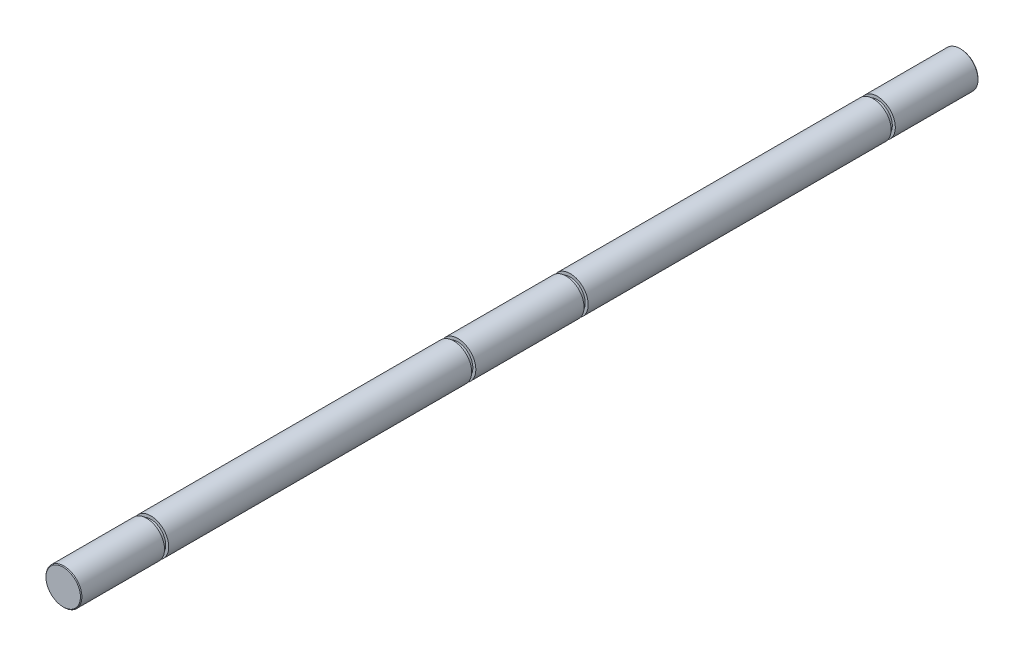
ISO-10303-21;
HEADER;
FILE_DESCRIPTION(('STEP AP214'),'2;1');
FILE_NAME('part.step','',(''),(''),'','','');
FILE_SCHEMA(('AUTOMOTIVE_DESIGN { 1 0 10303 214 1 1 1 1 }'));
ENDSEC;
DATA;
#1=APPLICATION_CONTEXT('core data for automotive mechanical design processes');
#2=APPLICATION_PROTOCOL_DEFINITION('international standard','automotive_design',2000,#1);
#3=PRODUCT_CONTEXT('',#1,'mechanical');
#4=PRODUCT('Part','Part','',(#3));
#5=PRODUCT_RELATED_PRODUCT_CATEGORY('part','',(#4));
#6=PRODUCT_DEFINITION_FORMATION('','',#4);
#7=PRODUCT_DEFINITION_CONTEXT('part definition',#1,'design');
#8=PRODUCT_DEFINITION('design','',#6,#7);
#9=PRODUCT_DEFINITION_SHAPE('','',#8);
#10=(LENGTH_UNIT() NAMED_UNIT(*) SI_UNIT(.MILLI.,.METRE.));
#11=(NAMED_UNIT(*) PLANE_ANGLE_UNIT() SI_UNIT($,.RADIAN.));
#12=(NAMED_UNIT(*) SI_UNIT($,.STERADIAN.) SOLID_ANGLE_UNIT());
#13=UNCERTAINTY_MEASURE_WITH_UNIT(LENGTH_MEASURE(1.E-05),#10,'distance_accuracy_value','');
#14=(GEOMETRIC_REPRESENTATION_CONTEXT(3) GLOBAL_UNCERTAINTY_ASSIGNED_CONTEXT((#13)) GLOBAL_UNIT_ASSIGNED_CONTEXT((#10,
#11,#12)) REPRESENTATION_CONTEXT('',''));
#15=CARTESIAN_POINT('',(0.,0.,0.));
#16=DIRECTION('',(0.,0.,1.));
#17=DIRECTION('',(1.,0.,0.));
#18=AXIS2_PLACEMENT_3D('',#15,#16,#17);
#19=CARTESIAN_POINT('',(0.,0.,75.));
#20=DIRECTION('',(0.,0.,-1.));
#21=DIRECTION('',(-1.,0.,0.));
#22=AXIS2_PLACEMENT_3D('',#19,#20,#21);
#23=CYLINDRICAL_SURFACE('',#22,3.);
#24=CARTESIAN_POINT('',(0.,0.,9.04));
#25=DIRECTION('',(0.,0.,1.));
#26=DIRECTION('',(1.,0.,0.));
#27=AXIS2_PLACEMENT_3D('',#24,#25,#26);
#28=CIRCLE('',#27,3.);
#29=CARTESIAN_POINT('',(3.,0.,9.04));
#30=VERTEX_POINT('',#29);
#31=EDGE_CURVE('E88',#30,#30,#28,.T.);
#32=ORIENTED_EDGE('',*,*,#31,.F.);
#33=EDGE_LOOP('',(#32));
#34=FACE_BOUND('',#33,.T.);
#35=CARTESIAN_POINT('',(0.,0.,-9.04));
#36=DIRECTION('',(0.,0.,1.));
#37=DIRECTION('',(1.,0.,0.));
#38=AXIS2_PLACEMENT_3D('',#35,#36,#37);
#39=CIRCLE('',#38,3.);
#40=CARTESIAN_POINT('',(3.,0.,-9.04));
#41=VERTEX_POINT('',#40);
#42=EDGE_CURVE('E100',#41,#41,#39,.T.);
#43=ORIENTED_EDGE('',*,*,#42,.T.);
#44=EDGE_LOOP('',(#43));
#45=FACE_BOUND('',#44,.T.);
#46=ADVANCED_FACE('F46',(#34,#45),#23,.T.);
#47=CARTESIAN_POINT('',(0.,0.,9.04));
#48=DIRECTION('',(0.,0.,1.));
#49=DIRECTION('',(1.,0.,0.));
#50=AXIS2_PLACEMENT_3D('',#47,#48,#49);
#51=PLANE('',#50);
#52=CARTESIAN_POINT('',(0.,0.,9.04));
#53=DIRECTION('',(0.,0.,1.));
#54=DIRECTION('',(1.,0.,0.));
#55=AXIS2_PLACEMENT_3D('',#52,#53,#54);
#56=CIRCLE('',#55,2.5);
#57=CARTESIAN_POINT('',(2.5,0.,9.04));
#58=VERTEX_POINT('',#57);
#59=EDGE_CURVE('E94',#58,#58,#56,.T.);
#60=ORIENTED_EDGE('',*,*,#59,.F.);
#61=EDGE_LOOP('',(#60));
#62=FACE_BOUND('',#61,.T.);
#63=ORIENTED_EDGE('',*,*,#31,.T.);
#64=EDGE_LOOP('',(#63));
#65=FACE_BOUND('',#64,.T.);
#66=ADVANCED_FACE('F136',(#62,#65),#51,.T.);
#67=CARTESIAN_POINT('',(0.,0.,9.74));
#68=DIRECTION('',(0.,0.,1.));
#69=DIRECTION('',(1.,0.,0.));
#70=AXIS2_PLACEMENT_3D('',#67,#68,#69);
#71=PLANE('',#70);
#72=CARTESIAN_POINT('',(0.,0.,9.74));
#73=DIRECTION('',(0.,0.,1.));
#74=DIRECTION('',(1.,0.,0.));
#75=AXIS2_PLACEMENT_3D('',#72,#73,#74);
#76=CIRCLE('',#75,2.5);
#77=CARTESIAN_POINT('',(2.5,0.,9.74));
#78=VERTEX_POINT('',#77);
#79=EDGE_CURVE('E97',#78,#78,#76,.T.);
#80=ORIENTED_EDGE('',*,*,#79,.T.);
#81=EDGE_LOOP('',(#80));
#82=FACE_BOUND('',#81,.T.);
#83=CARTESIAN_POINT('',(0.,0.,9.74));
#84=DIRECTION('',(0.,0.,1.));
#85=DIRECTION('',(1.,0.,0.));
#86=AXIS2_PLACEMENT_3D('',#83,#84,#85);
#87=CIRCLE('',#86,3.);
#88=CARTESIAN_POINT('',(3.,0.,9.74));
#89=VERTEX_POINT('',#88);
#90=EDGE_CURVE('E91',#89,#89,#87,.T.);
#91=ORIENTED_EDGE('',*,*,#90,.F.);
#92=EDGE_LOOP('',(#91));
#93=FACE_BOUND('',#92,.T.);
#94=ADVANCED_FACE('F144',(#82,#93),#71,.F.);
#95=CARTESIAN_POINT('',(0.,0.,9.04));
#96=DIRECTION('',(0.,0.,1.));
#97=DIRECTION('',(1.,0.,0.));
#98=AXIS2_PLACEMENT_3D('',#95,#96,#97);
#99=CYLINDRICAL_SURFACE('',#98,2.5);
#100=ORIENTED_EDGE('',*,*,#59,.T.);
#101=EDGE_LOOP('',(#100));
#102=FACE_BOUND('',#101,.T.);
#103=ORIENTED_EDGE('',*,*,#79,.F.);
#104=EDGE_LOOP('',(#103));
#105=FACE_BOUND('',#104,.T.);
#106=ADVANCED_FACE('F195',(#102,#105),#99,.T.);
#107=CARTESIAN_POINT('',(0.,0.,75.));
#108=DIRECTION('',(0.,0.,1.));
#109=DIRECTION('',(1.,0.,0.));
#110=AXIS2_PLACEMENT_3D('',#107,#108,#109);
#111=PLANE('',#110);
#112=CARTESIAN_POINT('',(0.,0.,75.));
#113=DIRECTION('',(0.,0.,1.));
#114=DIRECTION('',(1.,0.,0.));
#115=AXIS2_PLACEMENT_3D('',#112,#113,#114);
#116=CIRCLE('',#115,2.88000000000001);
#117=CARTESIAN_POINT('',(2.88000000000001,0.,75.));
#118=VERTEX_POINT('',#117);
#119=EDGE_CURVE('E12',#118,#118,#116,.T.);
#120=ORIENTED_EDGE('',*,*,#119,.T.);
#121=EDGE_LOOP('',(#120));
#122=FACE_BOUND('',#121,.T.);
#123=ADVANCED_FACE('F164',(#122),#111,.T.);
#124=CARTESIAN_POINT('',(0.,0.,75.));
#125=DIRECTION('',(0.,0.,-1.));
#126=DIRECTION('',(-1.,0.,0.));
#127=AXIS2_PLACEMENT_3D('',#124,#125,#126);
#128=CONICAL_SURFACE('',#127,2.88000000000001,0.785398163397439);
#129=CARTESIAN_POINT('',(0.,0.,74.88));
#130=DIRECTION('',(0.,0.,1.));
#131=DIRECTION('',(1.,0.,0.));
#132=AXIS2_PLACEMENT_3D('',#129,#130,#131);
#133=CIRCLE('',#132,3.);
#134=CARTESIAN_POINT('',(3.,0.,74.88));
#135=VERTEX_POINT('',#134);
#136=EDGE_CURVE('E61',#135,#135,#133,.F.);
#137=ORIENTED_EDGE('',*,*,#136,.F.);
#138=EDGE_LOOP('',(#137));
#139=FACE_BOUND('',#138,.T.);
#140=ORIENTED_EDGE('',*,*,#119,.F.);
#141=EDGE_LOOP('',(#140));
#142=FACE_BOUND('',#141,.T.);
#143=ADVANCED_FACE('F48',(#139,#142),#128,.T.);
#144=CARTESIAN_POINT('',(0.,0.,61.063942634));
#145=DIRECTION('',(0.,0.,1.));
#146=DIRECTION('',(1.,0.,0.));
#147=AXIS2_PLACEMENT_3D('',#144,#145,#146);
#148=CIRCLE('',#147,3.);
#149=CARTESIAN_POINT('',(3.,0.,61.063942634));
#150=VERTEX_POINT('',#149);
#151=EDGE_CURVE('E67',#150,#150,#148,.T.);
#152=ORIENTED_EDGE('',*,*,#151,.T.);
#153=EDGE_LOOP('',(#152));
#154=FACE_BOUND('',#153,.T.);
#155=ORIENTED_EDGE('',*,*,#136,.T.);
#156=EDGE_LOOP('',(#155));
#157=FACE_BOUND('',#156,.T.);
#158=ADVANCED_FACE('F140',(#154,#157),#23,.T.);
#159=CARTESIAN_POINT('',(0.,0.,61.063942634));
#160=DIRECTION('',(0.,0.,1.));
#161=DIRECTION('',(1.,0.,0.));
#162=AXIS2_PLACEMENT_3D('',#159,#160,#161);
#163=PLANE('',#162);
#164=CARTESIAN_POINT('',(0.,0.,61.063942634));
#165=DIRECTION('',(0.,0.,1.));
#166=DIRECTION('',(1.,0.,0.));
#167=AXIS2_PLACEMENT_3D('',#164,#165,#166);
#168=CIRCLE('',#167,2.5);
#169=CARTESIAN_POINT('',(2.5,0.,61.063942634));
#170=VERTEX_POINT('',#169);
#171=EDGE_CURVE('E73',#170,#170,#168,.T.);
#172=ORIENTED_EDGE('',*,*,#171,.T.);
#173=EDGE_LOOP('',(#172));
#174=FACE_BOUND('',#173,.T.);
#175=ORIENTED_EDGE('',*,*,#151,.F.);
#176=EDGE_LOOP('',(#175));
#177=FACE_BOUND('',#176,.T.);
#178=ADVANCED_FACE('F154',(#174,#177),#163,.F.);
#179=CARTESIAN_POINT('',(0.,0.,60.363942634));
#180=DIRECTION('',(0.,0.,1.));
#181=DIRECTION('',(1.,0.,0.));
#182=AXIS2_PLACEMENT_3D('',#179,#180,#181);
#183=CYLINDRICAL_SURFACE('',#182,2.5);
#184=CARTESIAN_POINT('',(0.,0.,60.363942634));
#185=DIRECTION('',(0.,0.,1.));
#186=DIRECTION('',(1.,0.,0.));
#187=AXIS2_PLACEMENT_3D('',#184,#185,#186);
#188=CIRCLE('',#187,2.5);
#189=CARTESIAN_POINT('',(2.5,0.,60.363942634));
#190=VERTEX_POINT('',#189);
#191=EDGE_CURVE('E70',#190,#190,#188,.T.);
#192=ORIENTED_EDGE('',*,*,#191,.T.);
#193=EDGE_LOOP('',(#192));
#194=FACE_BOUND('',#193,.T.);
#195=ORIENTED_EDGE('',*,*,#171,.F.);
#196=EDGE_LOOP('',(#195));
#197=FACE_BOUND('',#196,.T.);
#198=ADVANCED_FACE('F161',(#194,#197),#183,.T.);
#199=CARTESIAN_POINT('',(0.,0.,60.363942634));
#200=DIRECTION('',(0.,0.,1.));
#201=DIRECTION('',(1.,0.,0.));
#202=AXIS2_PLACEMENT_3D('',#199,#200,#201);
#203=PLANE('',#202);
#204=ORIENTED_EDGE('',*,*,#191,.F.);
#205=EDGE_LOOP('',(#204));
#206=FACE_BOUND('',#205,.T.);
#207=CARTESIAN_POINT('',(0.,0.,60.363942634));
#208=DIRECTION('',(0.,0.,1.));
#209=DIRECTION('',(1.,0.,0.));
#210=AXIS2_PLACEMENT_3D('',#207,#208,#209);
#211=CIRCLE('',#210,3.);
#212=CARTESIAN_POINT('',(3.,0.,60.363942634));
#213=VERTEX_POINT('',#212);
#214=EDGE_CURVE('E66',#213,#213,#211,.T.);
#215=ORIENTED_EDGE('',*,*,#214,.T.);
#216=EDGE_LOOP('',(#215));
#217=FACE_BOUND('',#216,.T.);
#218=ADVANCED_FACE('F182',(#206,#217),#203,.T.);
#219=ORIENTED_EDGE('',*,*,#90,.T.);
#220=EDGE_LOOP('',(#219));
#221=FACE_BOUND('',#220,.T.);
#222=ORIENTED_EDGE('',*,*,#214,.F.);
#223=EDGE_LOOP('',(#222));
#224=FACE_BOUND('',#223,.T.);
#225=ADVANCED_FACE('F131',(#221,#224),#23,.T.);
#226=CARTESIAN_POINT('',(0.,0.,-9.04));
#227=DIRECTION('',(0.,0.,-1.));
#228=DIRECTION('',(1.,0.,0.));
#229=AXIS2_PLACEMENT_3D('',#226,#227,#228);
#230=PLANE('',#229);
#231=ORIENTED_EDGE('',*,*,#42,.F.);
#232=EDGE_LOOP('',(#231));
#233=FACE_BOUND('',#232,.T.);
#234=CARTESIAN_POINT('',(0.,0.,-9.04));
#235=DIRECTION('',(0.,0.,1.));
#236=DIRECTION('',(1.,0.,0.));
#237=AXIS2_PLACEMENT_3D('',#234,#235,#236);
#238=CIRCLE('',#237,2.5);
#239=CARTESIAN_POINT('',(2.5,0.,-9.04));
#240=VERTEX_POINT('',#239);
#241=EDGE_CURVE('E106',#240,#240,#238,.T.);
#242=ORIENTED_EDGE('',*,*,#241,.T.);
#243=EDGE_LOOP('',(#242));
#244=FACE_BOUND('',#243,.T.);
#245=ADVANCED_FACE('F115',(#233,#244),#230,.T.);
#246=CARTESIAN_POINT('',(0.,0.,-9.74));
#247=DIRECTION('',(0.,0.,-1.));
#248=DIRECTION('',(1.,0.,0.));
#249=AXIS2_PLACEMENT_3D('',#246,#247,#248);
#250=PLANE('',#249);
#251=CARTESIAN_POINT('',(0.,0.,-9.74));
#252=DIRECTION('',(0.,0.,1.));
#253=DIRECTION('',(1.,0.,0.));
#254=AXIS2_PLACEMENT_3D('',#251,#252,#253);
#255=CIRCLE('',#254,3.);
#256=CARTESIAN_POINT('',(3.,0.,-9.74));
#257=VERTEX_POINT('',#256);
#258=EDGE_CURVE('E103',#257,#257,#255,.T.);
#259=ORIENTED_EDGE('',*,*,#258,.T.);
#260=EDGE_LOOP('',(#259));
#261=FACE_BOUND('',#260,.T.);
#262=CARTESIAN_POINT('',(0.,0.,-9.74));
#263=DIRECTION('',(0.,0.,1.));
#264=DIRECTION('',(1.,0.,0.));
#265=AXIS2_PLACEMENT_3D('',#262,#263,#264);
#266=CIRCLE('',#265,2.5);
#267=CARTESIAN_POINT('',(2.5,0.,-9.74));
#268=VERTEX_POINT('',#267);
#269=EDGE_CURVE('E109',#268,#268,#266,.T.);
#270=ORIENTED_EDGE('',*,*,#269,.F.);
#271=EDGE_LOOP('',(#270));
#272=FACE_BOUND('',#271,.T.);
#273=ADVANCED_FACE('F121',(#261,#272),#250,.F.);
#274=CARTESIAN_POINT('',(0.,0.,-9.04));
#275=DIRECTION('',(0.,0.,-1.));
#276=DIRECTION('',(-1.,0.,0.));
#277=AXIS2_PLACEMENT_3D('',#274,#275,#276);
#278=CYLINDRICAL_SURFACE('',#277,2.5);
#279=ORIENTED_EDGE('',*,*,#241,.F.);
#280=EDGE_LOOP('',(#279));
#281=FACE_BOUND('',#280,.T.);
#282=ORIENTED_EDGE('',*,*,#269,.T.);
#283=EDGE_LOOP('',(#282));
#284=FACE_BOUND('',#283,.T.);
#285=ADVANCED_FACE('F117',(#281,#284),#278,.T.);
#286=CARTESIAN_POINT('',(0.,0.,-75.));
#287=DIRECTION('',(0.,0.,1.));
#288=DIRECTION('',(1.,0.,0.));
#289=AXIS2_PLACEMENT_3D('',#286,#287,#288);
#290=PLANE('',#289);
#291=CARTESIAN_POINT('',(0.,0.,-75.));
#292=DIRECTION('',(0.,0.,1.));
#293=DIRECTION('',(1.,0.,0.));
#294=AXIS2_PLACEMENT_3D('',#291,#292,#293);
#295=CIRCLE('',#294,2.87999999999998);
#296=CARTESIAN_POINT('',(2.87999999999998,0.,-75.));
#297=VERTEX_POINT('',#296);
#298=EDGE_CURVE('E53',#297,#297,#295,.F.);
#299=ORIENTED_EDGE('',*,*,#298,.T.);
#300=EDGE_LOOP('',(#299));
#301=FACE_BOUND('',#300,.T.);
#302=ADVANCED_FACE('F120',(#301),#290,.F.);
#303=CARTESIAN_POINT('',(0.,0.,-74.88));
#304=DIRECTION('',(0.,0.,1.));
#305=DIRECTION('',(1.,0.,0.));
#306=AXIS2_PLACEMENT_3D('',#303,#304,#305);
#307=CONICAL_SURFACE('',#306,3.,0.785398163397382);
#308=ORIENTED_EDGE('',*,*,#298,.F.);
#309=EDGE_LOOP('',(#308));
#310=FACE_BOUND('',#309,.T.);
#311=CARTESIAN_POINT('',(0.,0.,-74.88));
#312=DIRECTION('',(0.,0.,1.));
#313=DIRECTION('',(1.,0.,0.));
#314=AXIS2_PLACEMENT_3D('',#311,#312,#313);
#315=CIRCLE('',#314,3.);
#316=CARTESIAN_POINT('',(3.,0.,-74.88));
#317=VERTEX_POINT('',#316);
#318=EDGE_CURVE('E57',#317,#317,#315,.T.);
#319=ORIENTED_EDGE('',*,*,#318,.F.);
#320=EDGE_LOOP('',(#319));
#321=FACE_BOUND('',#320,.T.);
#322=ADVANCED_FACE('F169',(#310,#321),#307,.T.);
#323=CARTESIAN_POINT('',(0.,0.,-61.063942634));
#324=DIRECTION('',(0.,0.,1.));
#325=DIRECTION('',(1.,0.,0.));
#326=AXIS2_PLACEMENT_3D('',#323,#324,#325);
#327=CIRCLE('',#326,3.);
#328=CARTESIAN_POINT('',(3.,0.,-61.063942634));
#329=VERTEX_POINT('',#328);
#330=EDGE_CURVE('E79',#329,#329,#327,.T.);
#331=ORIENTED_EDGE('',*,*,#330,.F.);
#332=EDGE_LOOP('',(#331));
#333=FACE_BOUND('',#332,.T.);
#334=ORIENTED_EDGE('',*,*,#318,.T.);
#335=EDGE_LOOP('',(#334));
#336=FACE_BOUND('',#335,.T.);
#337=ADVANCED_FACE('F156',(#333,#336),#23,.T.);
#338=CARTESIAN_POINT('',(0.,0.,-61.063942634));
#339=DIRECTION('',(0.,0.,-1.));
#340=DIRECTION('',(1.,0.,0.));
#341=AXIS2_PLACEMENT_3D('',#338,#339,#340);
#342=PLANE('',#341);
#343=ORIENTED_EDGE('',*,*,#330,.T.);
#344=EDGE_LOOP('',(#343));
#345=FACE_BOUND('',#344,.T.);
#346=CARTESIAN_POINT('',(0.,0.,-61.063942634));
#347=DIRECTION('',(0.,0.,1.));
#348=DIRECTION('',(1.,0.,0.));
#349=AXIS2_PLACEMENT_3D('',#346,#347,#348);
#350=CIRCLE('',#349,2.5);
#351=CARTESIAN_POINT('',(2.5,0.,-61.063942634));
#352=VERTEX_POINT('',#351);
#353=EDGE_CURVE('E85',#352,#352,#350,.T.);
#354=ORIENTED_EDGE('',*,*,#353,.F.);
#355=EDGE_LOOP('',(#354));
#356=FACE_BOUND('',#355,.T.);
#357=ADVANCED_FACE('F168',(#345,#356),#342,.F.);
#358=CARTESIAN_POINT('',(0.,0.,-60.363942634));
#359=DIRECTION('',(0.,0.,-1.));
#360=DIRECTION('',(-1.,0.,0.));
#361=AXIS2_PLACEMENT_3D('',#358,#359,#360);
#362=CYLINDRICAL_SURFACE('',#361,2.5);
#363=CARTESIAN_POINT('',(0.,0.,-60.363942634));
#364=DIRECTION('',(0.,0.,1.));
#365=DIRECTION('',(1.,0.,0.));
#366=AXIS2_PLACEMENT_3D('',#363,#364,#365);
#367=CIRCLE('',#366,2.5);
#368=CARTESIAN_POINT('',(2.5,0.,-60.363942634));
#369=VERTEX_POINT('',#368);
#370=EDGE_CURVE('E82',#369,#369,#367,.T.);
#371=ORIENTED_EDGE('',*,*,#370,.F.);
#372=EDGE_LOOP('',(#371));
#373=FACE_BOUND('',#372,.T.);
#374=ORIENTED_EDGE('',*,*,#353,.T.);
#375=EDGE_LOOP('',(#374));
#376=FACE_BOUND('',#375,.T.);
#377=ADVANCED_FACE('F175',(#373,#376),#362,.T.);
#378=CARTESIAN_POINT('',(0.,0.,-60.363942634));
#379=DIRECTION('',(0.,0.,-1.));
#380=DIRECTION('',(1.,0.,0.));
#381=AXIS2_PLACEMENT_3D('',#378,#379,#380);
#382=PLANE('',#381);
#383=CARTESIAN_POINT('',(0.,0.,-60.363942634));
#384=DIRECTION('',(0.,0.,1.));
#385=DIRECTION('',(1.,0.,0.));
#386=AXIS2_PLACEMENT_3D('',#383,#384,#385);
#387=CIRCLE('',#386,3.);
#388=CARTESIAN_POINT('',(3.,0.,-60.363942634));
#389=VERTEX_POINT('',#388);
#390=EDGE_CURVE('E76',#389,#389,#387,.T.);
#391=ORIENTED_EDGE('',*,*,#390,.F.);
#392=EDGE_LOOP('',(#391));
#393=FACE_BOUND('',#392,.T.);
#394=ORIENTED_EDGE('',*,*,#370,.T.);
#395=EDGE_LOOP('',(#394));
#396=FACE_BOUND('',#395,.T.);
#397=ADVANCED_FACE('F151',(#393,#396),#382,.T.);
#398=ORIENTED_EDGE('',*,*,#258,.F.);
#399=EDGE_LOOP('',(#398));
#400=FACE_BOUND('',#399,.T.);
#401=ORIENTED_EDGE('',*,*,#390,.T.);
#402=EDGE_LOOP('',(#401));
#403=FACE_BOUND('',#402,.T.);
#404=ADVANCED_FACE('F139',(#400,#403),#23,.T.);
#405=CLOSED_SHELL('',(#46,#66,#94,#106,#123,#143,#158,#178,#198,#218,#225,#245,#273,#285,#302,
#322,#337,#357,#377,#397,#404));
#406=MANIFOLD_SOLID_BREP('B2',#405);
#407=ADVANCED_BREP_SHAPE_REPRESENTATION('',(#18,#406),#14);
#408=SHAPE_DEFINITION_REPRESENTATION(#9,#407);
ENDSEC;
END-ISO-10303-21;
